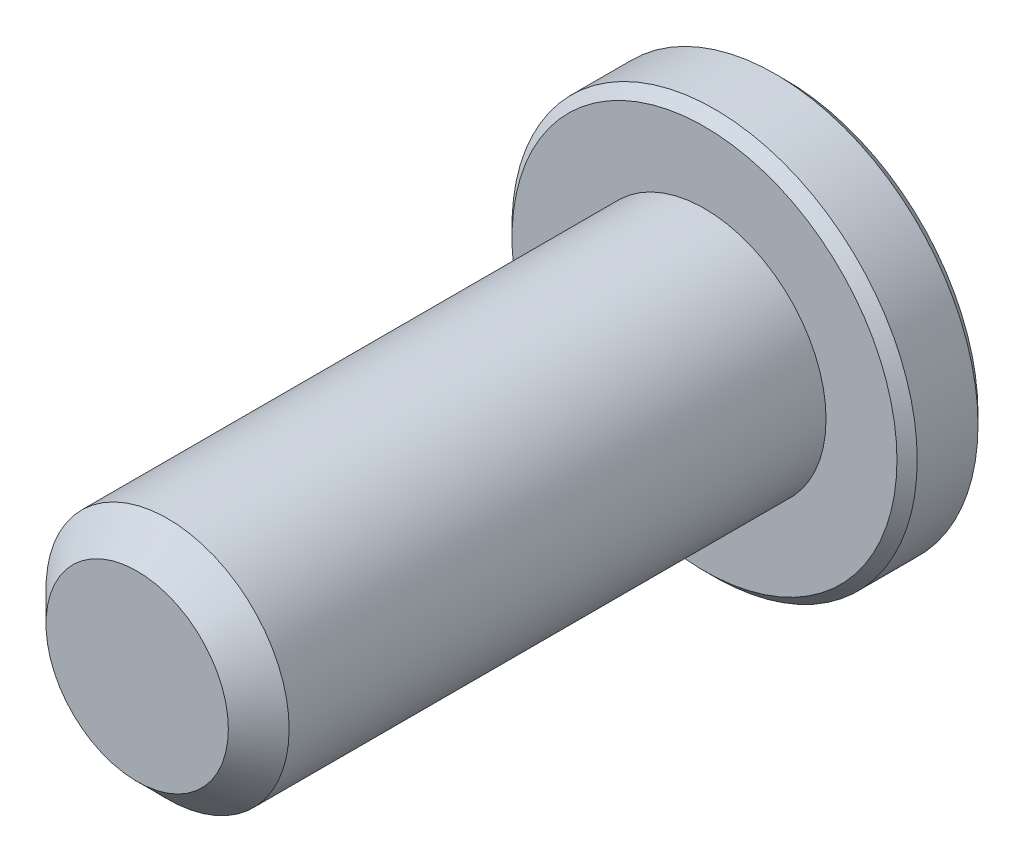
ISO-10303-21;
HEADER;
FILE_DESCRIPTION(('STEP AP214'),'2;1');
FILE_NAME('part.step','',(''),(''),'','','');
FILE_SCHEMA(('AUTOMOTIVE_DESIGN { 1 0 10303 214 1 1 1 1 }'));
ENDSEC;
DATA;
#1=APPLICATION_CONTEXT('core data for automotive mechanical design processes');
#2=APPLICATION_PROTOCOL_DEFINITION('international standard','automotive_design',2000,#1);
#3=PRODUCT_CONTEXT('',#1,'mechanical');
#4=PRODUCT('Part','Part','',(#3));
#5=PRODUCT_RELATED_PRODUCT_CATEGORY('part','',(#4));
#6=PRODUCT_DEFINITION_FORMATION('','',#4);
#7=PRODUCT_DEFINITION_CONTEXT('part definition',#1,'design');
#8=PRODUCT_DEFINITION('design','',#6,#7);
#9=PRODUCT_DEFINITION_SHAPE('','',#8);
#10=(LENGTH_UNIT() NAMED_UNIT(*) SI_UNIT(.MILLI.,.METRE.));
#11=(NAMED_UNIT(*) PLANE_ANGLE_UNIT() SI_UNIT($,.RADIAN.));
#12=(NAMED_UNIT(*) SI_UNIT($,.STERADIAN.) SOLID_ANGLE_UNIT());
#13=UNCERTAINTY_MEASURE_WITH_UNIT(LENGTH_MEASURE(1.E-05),#10,'distance_accuracy_value','');
#14=(GEOMETRIC_REPRESENTATION_CONTEXT(3) GLOBAL_UNCERTAINTY_ASSIGNED_CONTEXT((#13)) GLOBAL_UNIT_ASSIGNED_CONTEXT((#10,
#11,#12)) REPRESENTATION_CONTEXT('',''));
#15=CARTESIAN_POINT('',(0.,0.,0.));
#16=DIRECTION('',(0.,0.,1.));
#17=DIRECTION('',(1.,0.,0.));
#18=AXIS2_PLACEMENT_3D('',#15,#16,#17);
#19=CARTESIAN_POINT('',(0.,0.,-8.));
#20=DIRECTION('',(0.,0.,1.));
#21=DIRECTION('',(1.,0.,0.));
#22=AXIS2_PLACEMENT_3D('',#19,#20,#21);
#23=PLANE('',#22);
#24=CARTESIAN_POINT('',(0.,0.,-8.));
#25=DIRECTION('',(0.,0.,1.));
#26=DIRECTION('',(1.,0.,0.));
#27=AXIS2_PLACEMENT_3D('',#24,#25,#26);
#28=CIRCLE('',#27,4.75);
#29=CARTESIAN_POINT('',(4.75,0.,-8.));
#30=VERTEX_POINT('',#29);
#31=EDGE_CURVE('E160',#30,#30,#28,.F.);
#32=ORIENTED_EDGE('',*,*,#31,.T.);
#33=EDGE_LOOP('',(#32));
#34=FACE_BOUND('',#33,.T.);
#35=CARTESIAN_POINT('',(0.,0.,-8.));
#36=DIRECTION('',(0.,0.,1.));
#37=DIRECTION('',(1.,0.,0.));
#38=AXIS2_PLACEMENT_3D('',#35,#36,#37);
#39=CIRCLE('',#38,2.3094010767585);
#40=CARTESIAN_POINT('',(2.,1.15470053837925,-8.));
#41=VERTEX_POINT('',#40);
#42=CARTESIAN_POINT('',(0.,2.3094010767585,-8.));
#43=VERTEX_POINT('',#42);
#44=EDGE_CURVE('E99',#41,#43,#39,.T.);
#45=ORIENTED_EDGE('',*,*,#44,.T.);
#46=CARTESIAN_POINT('',(0.,0.,-8.));
#47=DIRECTION('',(0.,0.,1.));
#48=DIRECTION('',(1.,0.,0.));
#49=AXIS2_PLACEMENT_3D('',#46,#47,#48);
#50=CIRCLE('',#49,2.3094010767585);
#51=CARTESIAN_POINT('',(-2.,1.15470053837925,-8.));
#52=VERTEX_POINT('',#51);
#53=EDGE_CURVE('E111',#43,#52,#50,.T.);
#54=ORIENTED_EDGE('',*,*,#53,.T.);
#55=CARTESIAN_POINT('',(0.,0.,-8.));
#56=DIRECTION('',(0.,0.,1.));
#57=DIRECTION('',(1.,0.,0.));
#58=AXIS2_PLACEMENT_3D('',#55,#56,#57);
#59=CIRCLE('',#58,2.3094010767585);
#60=CARTESIAN_POINT('',(-2.,-1.15470053837925,-8.));
#61=VERTEX_POINT('',#60);
#62=EDGE_CURVE('E132',#52,#61,#59,.T.);
#63=ORIENTED_EDGE('',*,*,#62,.T.);
#64=CARTESIAN_POINT('',(0.,0.,-8.));
#65=DIRECTION('',(0.,0.,1.));
#66=DIRECTION('',(1.,0.,0.));
#67=AXIS2_PLACEMENT_3D('',#64,#65,#66);
#68=CIRCLE('',#67,2.3094010767585);
#69=CARTESIAN_POINT('',(0.,-2.3094010767585,-8.));
#70=VERTEX_POINT('',#69);
#71=EDGE_CURVE('E417',#61,#70,#68,.T.);
#72=ORIENTED_EDGE('',*,*,#71,.T.);
#73=CARTESIAN_POINT('',(0.,0.,-8.));
#74=DIRECTION('',(0.,0.,1.));
#75=DIRECTION('',(1.,0.,0.));
#76=AXIS2_PLACEMENT_3D('',#73,#74,#75);
#77=CIRCLE('',#76,2.3094010767585);
#78=CARTESIAN_POINT('',(2.,-1.15470053837925,-8.));
#79=VERTEX_POINT('',#78);
#80=EDGE_CURVE('E418',#70,#79,#77,.T.);
#81=ORIENTED_EDGE('',*,*,#80,.T.);
#82=CARTESIAN_POINT('',(0.,0.,-8.));
#83=DIRECTION('',(0.,0.,1.));
#84=DIRECTION('',(1.,0.,0.));
#85=AXIS2_PLACEMENT_3D('',#82,#83,#84);
#86=CIRCLE('',#85,2.3094010767585);
#87=EDGE_CURVE('E114',#79,#41,#86,.T.);
#88=ORIENTED_EDGE('',*,*,#87,.T.);
#89=EDGE_LOOP('',(#45,#54,#63,#72,#81,#88));
#90=FACE_BOUND('',#89,.T.);
#91=ADVANCED_FACE('F40',(#34,#90),#23,.F.);
#92=CARTESIAN_POINT('',(2.,1.15470053837925,-6.5));
#93=DIRECTION('',(-0.499999999999999,-0.866025403784439,0.));
#94=DIRECTION('',(0.866025403784439,-0.499999999999999,0.));
#95=AXIS2_PLACEMENT_3D('',#92,#93,#94);
#96=PLANE('',#95);
#97=DIRECTION('',(0.,0.,-1.));
#98=VECTOR('',#97,1.);
#99=CARTESIAN_POINT('',(0.,2.3094010767585,-6.5));
#100=LINE('',#99,#98);
#101=CARTESIAN_POINT('',(0.,2.3094010767585,-6.5));
#102=VERTEX_POINT('',#101);
#103=EDGE_CURVE('E128',#102,#43,#100,.T.);
#104=ORIENTED_EDGE('',*,*,#103,.T.);
#105=CARTESIAN_POINT('',(2.0002,1.15458506832541,-8.00011547871366));
#106=CARTESIAN_POINT('',(1.93144696596929,1.19427965103065,-7.96045309022559));
#107=CARTESIAN_POINT('',(1.86154425786449,1.23463799837204,-7.92311998228416));
#108=CARTESIAN_POINT('',(1.71900475544956,1.31693321846145,-7.85476368513614));
#109=CARTESIAN_POINT('',(1.64635440243464,1.35887791933134,-7.82377853373722));
#110=CARTESIAN_POINT('',(1.49985839894603,1.44345742638069,-7.77070021654414));
#111=CARTESIAN_POINT('',(1.4260500647537,1.48607068799507,-7.74847362717661));
#112=CARTESIAN_POINT('',(1.27680836816473,1.57223542169503,-7.71422881667508));
#113=CARTESIAN_POINT('',(1.20137956608184,1.61578426088223,-7.70218502914413));
#114=CARTESIAN_POINT('',(1.07138449932892,1.69083694766536,-7.69131851190557));
#115=CARTESIAN_POINT('',(1.01698621602989,1.72224381117151,-7.68970975360997));
#116=CARTESIAN_POINT('',(0.908278544480303,1.78500621460364,-7.69241887759871));
#117=CARTESIAN_POINT('',(0.853969194078657,1.81636173267754,-7.69673883775797));
#118=CARTESIAN_POINT('',(0.745863272410659,1.87877671565355,-7.71105956740991));
#119=CARTESIAN_POINT('',(0.692067343445204,1.90983580972306,-7.72106669276201));
#120=CARTESIAN_POINT('',(0.585405737694423,1.97141691651547,-7.74621243024966));
#121=CARTESIAN_POINT('',(0.532539989929284,2.00193897021859,-7.76135064904224));
#122=CARTESIAN_POINT('',(0.397120266910153,2.08012358375727,-7.80629450342919));
#123=CARTESIAN_POINT('',(0.315406165150519,2.12730124240478,-7.83948883942582));
#124=CARTESIAN_POINT('',(0.195252962742195,2.19667172615922,-7.89552582317137));
#125=CARTESIAN_POINT('',(0.155657147890821,2.21953238052245,-7.91521470294694));
#126=CARTESIAN_POINT('',(0.0771990411121258,2.26483018959123,-7.95638731836487));
#127=CARTESIAN_POINT('',(0.0383363164062579,2.28726759416161,-7.97786995165125));
#128=CARTESIAN_POINT('',(-0.00020000000000143,2.30951654681234,-8.00011547871366));
#129=B_SPLINE_CURVE_WITH_KNOTS('',3,(#105,#106,#107,#108,#109,#110,#111,#112,#113,#114,#115,
#116,#117,#118,#119,#120,#121,#122,#123,#124,#125,#126,#127,#128),.UNSPECIFIED.,.F.,.F.,(4,2,2,
2,2,2,2,2,2,2,2,4),(0.,0.266420613771064,0.534393751523389,0.798110374376915,1.06116288956936,
1.24939906803722,1.43770123566247,1.62621426093932,1.81471283831913,2.11415604834145,
2.2634717071779,2.4126962696977),.UNSPECIFIED.);
#130=EDGE_CURVE('E96',#41,#43,#129,.T.);
#131=ORIENTED_EDGE('',*,*,#130,.F.);
#132=DIRECTION('',(0.,0.,-1.));
#133=VECTOR('',#132,1.);
#134=CARTESIAN_POINT('',(2.,1.15470053837925,-6.5));
#135=LINE('',#134,#133);
#136=CARTESIAN_POINT('',(2.,1.15470053837925,-6.5));
#137=VERTEX_POINT('',#136);
#138=EDGE_CURVE('E395',#137,#41,#135,.T.);
#139=ORIENTED_EDGE('',*,*,#138,.F.);
#140=DIRECTION('',(-0.866025403784439,0.499999999999999,0.));
#141=VECTOR('',#140,1.);
#142=CARTESIAN_POINT('',(2.,1.15470053837925,-6.5));
#143=LINE('',#142,#141);
#144=EDGE_CURVE('E123',#137,#102,#143,.T.);
#145=ORIENTED_EDGE('',*,*,#144,.T.);
#146=EDGE_LOOP('',(#104,#131,#139,#145));
#147=FACE_BOUND('',#146,.T.);
#148=ADVANCED_FACE('F135',(#147),#96,.T.);
#149=CARTESIAN_POINT('',(2.,-1.15470053837925,-6.5));
#150=DIRECTION('',(-1.,0.,0.));
#151=DIRECTION('',(0.,-1.,0.));
#152=AXIS2_PLACEMENT_3D('',#149,#150,#151);
#153=PLANE('',#152);
#154=ORIENTED_EDGE('',*,*,#138,.T.);
#155=CARTESIAN_POINT('',(2.,-2.23549937670887,-8.69017513718668));
#156=CARTESIAN_POINT('',(2.,-2.1807527810435,-8.64938287180096));
#157=CARTESIAN_POINT('',(2.,-2.12569229943661,-8.60900569638314));
#158=CARTESIAN_POINT('',(2.,-2.0148226445702,-8.52926293233819));
#159=CARTESIAN_POINT('',(2.,-1.95901327979509,-8.48989761028182));
#160=CARTESIAN_POINT('',(2.,-1.84611729811028,-8.41208085304611));
#161=CARTESIAN_POINT('',(2.,-1.78902413232266,-8.37363887309905));
#162=CARTESIAN_POINT('',(2.,-1.67385795183992,-8.29826330524075));
#163=CARTESIAN_POINT('',(2.,-1.61578500814564,-8.26132960868766));
#164=CARTESIAN_POINT('',(2.,-1.43363866169992,-8.1494096906876));
#165=CARTESIAN_POINT('',(2.,-1.30762169581089,-8.07752720491179));
#166=CARTESIAN_POINT('',(2.,-1.04939309234471,-7.94646272873818));
#167=CARTESIAN_POINT('',(2.,-0.917204172269617,-7.88723804346547));
#168=CARTESIAN_POINT('',(2.,-0.718124984987984,-7.8148041590585));
#169=CARTESIAN_POINT('',(2.,-0.654042190204457,-7.79390698857068));
#170=CARTESIAN_POINT('',(2.,-0.524388769923568,-7.75726682008929));
#171=CARTESIAN_POINT('',(2.,-0.458818036623243,-7.74152419683206));
#172=CARTESIAN_POINT('',(2.,-0.327644241874374,-7.71625573335754));
#173=CARTESIAN_POINT('',(2.,-0.262061235219607,-7.70662737331007));
#174=CARTESIAN_POINT('',(2.,-0.130267847061914,-7.69376468439047));
#175=CARTESIAN_POINT('',(2.,-0.0640575622208006,-7.6905293859649));
#176=CARTESIAN_POINT('',(2.,0.0662403524896624,-7.69066851109366));
#177=CARTESIAN_POINT('',(2.,0.130328297737226,-7.69383531261846));
#178=CARTESIAN_POINT('',(2.,0.257921486730972,-7.70616059978116));
#179=CARTESIAN_POINT('',(2.,0.321426671256263,-7.71531968767288));
#180=CARTESIAN_POINT('',(2.,0.448468695628723,-7.73929657595525));
#181=CARTESIAN_POINT('',(2.,0.511987524654722,-7.75420841859142));
#182=CARTESIAN_POINT('',(2.,0.637645262926393,-7.78891873333844));
#183=CARTESIAN_POINT('',(2.,0.699784309324579,-7.80871671736778));
#184=CARTESIAN_POINT('',(2.,0.898631691500649,-7.87943332350435));
#185=CARTESIAN_POINT('',(2.,1.03242166016065,-7.93853646061718));
#186=CARTESIAN_POINT('',(2.,1.2936948848176,-8.06984386893366));
#187=CARTESIAN_POINT('',(2.,1.42115293421602,-8.1420958749312));
#188=CARTESIAN_POINT('',(2.,1.60534526733711,-8.25476923228805));
#189=CARTESIAN_POINT('',(2.,1.66407783886222,-8.2919864755451));
#190=CARTESIAN_POINT('',(2.,1.78053571406685,-8.36797661738813));
#191=CARTESIAN_POINT('',(2.,1.8382609404365,-8.40674963462693));
#192=CARTESIAN_POINT('',(2.,1.95236473925223,-8.4852415241609));
#193=CARTESIAN_POINT('',(2.,2.00875047098532,-8.52495004058222));
#194=CARTESIAN_POINT('',(2.,2.12075401913899,-8.60540490265382));
#195=CARTESIAN_POINT('',(2.,2.17637204190709,-8.64615096071051));
#196=CARTESIAN_POINT('',(2.,2.23166909348537,-8.68732162359563));
#197=B_SPLINE_CURVE_WITH_KNOTS('',3,(#155,#156,#157,#158,#159,#160,#161,#162,#163,#164,#165,
#166,#167,#168,#169,#170,#171,#172,#173,#174,#175,#176,#177,#178,#179,#180,#181,#182,#183,#184,
#185,#186,#187,#188,#189,#190,#191,#192,#193,#194,#195,#196),.UNSPECIFIED.,.F.,.F.,(4,2,2,2,2,2,
2,2,2,2,2,2,2,2,2,2,2,2,2,2,4),(0.,0.204822168658904,0.409697755456111,0.6161622341533,
0.822611814862053,1.25744760337585,1.69079269355485,1.89283154894661,2.0948850893337,
2.29345446193012,2.49199371775123,2.68419758165212,2.87642076594125,3.07192940138882,
3.26741851518362,3.70491849363615,4.14403963070311,4.3526147652202,4.56120583729728,
4.76808741684585,4.97491226257541),.UNSPECIFIED.);
#198=EDGE_CURVE('E104',#79,#41,#197,.T.);
#199=ORIENTED_EDGE('',*,*,#198,.F.);
#200=DIRECTION('',(0.,0.,-1.));
#201=VECTOR('',#200,1.);
#202=CARTESIAN_POINT('',(2.,-1.15470053837925,-6.5));
#203=LINE('',#202,#201);
#204=CARTESIAN_POINT('',(2.,-1.15470053837925,-6.5));
#205=VERTEX_POINT('',#204);
#206=EDGE_CURVE('E398',#205,#79,#203,.T.);
#207=ORIENTED_EDGE('',*,*,#206,.F.);
#208=DIRECTION('',(0.,1.,0.));
#209=VECTOR('',#208,1.);
#210=CARTESIAN_POINT('',(2.,-1.15470053837925,-6.5));
#211=LINE('',#210,#209);
#212=EDGE_CURVE('E56',#205,#137,#211,.T.);
#213=ORIENTED_EDGE('',*,*,#212,.T.);
#214=EDGE_LOOP('',(#154,#199,#207,#213));
#215=FACE_BOUND('',#214,.T.);
#216=ADVANCED_FACE('F184',(#215),#153,.T.);
#217=CARTESIAN_POINT('',(0.,-2.3094010767585,-6.5));
#218=DIRECTION('',(-0.5,0.866025403784438,0.));
#219=DIRECTION('',(-0.866025403784438,-0.5,0.));
#220=AXIS2_PLACEMENT_3D('',#217,#218,#219);
#221=PLANE('',#220);
#222=ORIENTED_EDGE('',*,*,#206,.T.);
#223=CARTESIAN_POINT('',(-0.000199999999999141,-2.30951654681234,-8.00011547871366));
#224=CARTESIAN_POINT('',(0.0685530340307063,-2.26982196410711,-7.96045309022559));
#225=CARTESIAN_POINT('',(0.138455742135512,-2.22946361676571,-7.92311998228416));
#226=CARTESIAN_POINT('',(0.280995244550437,-2.1471683966763,-7.85476368513614));
#227=CARTESIAN_POINT('',(0.353645597565359,-2.10522369580641,-7.82377853373722));
#228=CARTESIAN_POINT('',(0.500141601053972,-2.02064418875706,-7.77070021654414));
#229=CARTESIAN_POINT('',(0.573949935246294,-1.97803092714268,-7.74847362717661));
#230=CARTESIAN_POINT('',(0.723191631835264,-1.89186619344273,-7.71422881667508));
#231=CARTESIAN_POINT('',(0.798620433918152,-1.84831735425552,-7.70218502914413));
#232=CARTESIAN_POINT('',(0.928615500671079,-1.77326466747239,-7.69131851190557));
#233=CARTESIAN_POINT('',(0.983013783970109,-1.74185780396624,-7.68970975360997));
#234=CARTESIAN_POINT('',(1.09172145551969,-1.67909540053411,-7.69241887759871));
#235=CARTESIAN_POINT('',(1.14603080592134,-1.64773988246021,-7.69673883775797));
#236=CARTESIAN_POINT('',(1.25413672758934,-1.5853248994842,-7.7110595674099));
#237=CARTESIAN_POINT('',(1.30793265655479,-1.55426580541469,-7.72106669276201));
#238=CARTESIAN_POINT('',(1.41459426230557,-1.49268469862228,-7.74621243024966));
#239=CARTESIAN_POINT('',(1.46746001007071,-1.46216264491916,-7.76135064904224));
#240=CARTESIAN_POINT('',(1.60287973308984,-1.38397803138048,-7.80629450342919));
#241=CARTESIAN_POINT('',(1.68459383484948,-1.33680037273297,-7.83948883942581));
#242=CARTESIAN_POINT('',(1.8047470372578,-1.26742988897853,-7.89552582317137));
#243=CARTESIAN_POINT('',(1.84434285210917,-1.2445692346153,-7.91521470294694));
#244=CARTESIAN_POINT('',(1.92280095888787,-1.19927142554652,-7.95638731836487));
#245=CARTESIAN_POINT('',(1.96166368359374,-1.17683402097614,-7.97786995165125));
#246=CARTESIAN_POINT('',(2.0002,-1.15458506832541,-8.00011547871366));
#247=B_SPLINE_CURVE_WITH_KNOTS('',3,(#223,#224,#225,#226,#227,#228,#229,#230,#231,#232,#233,
#234,#235,#236,#237,#238,#239,#240,#241,#242,#243,#244,#245,#246),.UNSPECIFIED.,.F.,.F.,(4,2,2,
2,2,2,2,2,2,2,2,4),(0.,0.266420613771064,0.534393751523388,0.798110374376913,1.06116288956936,
1.24939906803722,1.43770123566247,1.62621426093931,1.81471283831913,2.11415604834144,
2.2634717071779,2.4126962696977),.UNSPECIFIED.);
#248=EDGE_CURVE('E426',#70,#79,#247,.T.);
#249=ORIENTED_EDGE('',*,*,#248,.F.);
#250=DIRECTION('',(0.,0.,-1.));
#251=VECTOR('',#250,1.);
#252=CARTESIAN_POINT('',(0.,-2.3094010767585,-6.5));
#253=LINE('',#252,#251);
#254=CARTESIAN_POINT('',(0.,-2.3094010767585,-6.5));
#255=VERTEX_POINT('',#254);
#256=EDGE_CURVE('E401',#255,#70,#253,.T.);
#257=ORIENTED_EDGE('',*,*,#256,.F.);
#258=DIRECTION('',(0.866025403784438,0.5,0.));
#259=VECTOR('',#258,1.);
#260=CARTESIAN_POINT('',(0.,-2.3094010767585,-6.5));
#261=LINE('',#260,#259);
#262=EDGE_CURVE('E64',#255,#205,#261,.T.);
#263=ORIENTED_EDGE('',*,*,#262,.T.);
#264=EDGE_LOOP('',(#222,#249,#257,#263));
#265=FACE_BOUND('',#264,.T.);
#266=ADVANCED_FACE('F302',(#265),#221,.T.);
#267=CARTESIAN_POINT('',(-2.,-1.15470053837925,-6.5));
#268=DIRECTION('',(0.5,0.866025403784439,0.));
#269=DIRECTION('',(-0.866025403784439,0.5,0.));
#270=AXIS2_PLACEMENT_3D('',#267,#268,#269);
#271=PLANE('',#270);
#272=ORIENTED_EDGE('',*,*,#256,.T.);
#273=CARTESIAN_POINT('',(-2.0002,-1.15458506832541,-8.00011547871366));
#274=CARTESIAN_POINT('',(-1.93144696596929,-1.19427965103064,-7.96045309022559));
#275=CARTESIAN_POINT('',(-1.86154425786449,-1.23463799837204,-7.92311998228416));
#276=CARTESIAN_POINT('',(-1.71900475544956,-1.31693321846145,-7.85476368513614));
#277=CARTESIAN_POINT('',(-1.64635440243464,-1.35887791933134,-7.82377853373722));
#278=CARTESIAN_POINT('',(-1.49985839894603,-1.44345742638069,-7.77070021654414));
#279=CARTESIAN_POINT('',(-1.4260500647537,-1.48607068799507,-7.74847362717661));
#280=CARTESIAN_POINT('',(-1.27680836816473,-1.57223542169502,-7.71422881667508));
#281=CARTESIAN_POINT('',(-1.20137956608185,-1.61578426088223,-7.70218502914413));
#282=CARTESIAN_POINT('',(-1.07138449932892,-1.69083694766536,-7.69131851190557));
#283=CARTESIAN_POINT('',(-1.01698621602989,-1.72224381117151,-7.68970975360997));
#284=CARTESIAN_POINT('',(-0.908278544480304,-1.78500621460364,-7.69241887759871));
#285=CARTESIAN_POINT('',(-0.853969194078658,-1.81636173267754,-7.69673883775797));
#286=CARTESIAN_POINT('',(-0.745863272410659,-1.87877671565355,-7.7110595674099));
#287=CARTESIAN_POINT('',(-0.692067343445205,-1.90983580972306,-7.72106669276201));
#288=CARTESIAN_POINT('',(-0.585405737694424,-1.97141691651547,-7.74621243024966));
#289=CARTESIAN_POINT('',(-0.532539989929284,-2.00193897021859,-7.76135064904224));
#290=CARTESIAN_POINT('',(-0.397120266910153,-2.08012358375727,-7.80629450342919));
#291=CARTESIAN_POINT('',(-0.31540616515052,-2.12730124240478,-7.83948883942581));
#292=CARTESIAN_POINT('',(-0.195252962742196,-2.19667172615922,-7.89552582317137));
#293=CARTESIAN_POINT('',(-0.155657147890822,-2.21953238052244,-7.91521470294694));
#294=CARTESIAN_POINT('',(-0.0771990411121268,-2.26483018959123,-7.95638731836487));
#295=CARTESIAN_POINT('',(-0.0383363164062588,-2.28726759416161,-7.97786995165124));
#296=CARTESIAN_POINT('',(0.000200000000000729,-2.30951654681234,-8.00011547871366));
#297=B_SPLINE_CURVE_WITH_KNOTS('',3,(#273,#274,#275,#276,#277,#278,#279,#280,#281,#282,#283,
#284,#285,#286,#287,#288,#289,#290,#291,#292,#293,#294,#295,#296),.UNSPECIFIED.,.F.,.F.,(4,2,2,
2,2,2,2,2,2,2,2,4),(0.,0.266420613771066,0.53439375152339,0.798110374376916,1.06116288956937,
1.24939906803722,1.43770123566248,1.62621426093932,1.81471283831913,2.11415604834145,
2.2634717071779,2.41269626969771),.UNSPECIFIED.);
#298=EDGE_CURVE('E414',#61,#70,#297,.T.);
#299=ORIENTED_EDGE('',*,*,#298,.F.);
#300=DIRECTION('',(0.,0.,-1.));
#301=VECTOR('',#300,1.);
#302=CARTESIAN_POINT('',(-2.,-1.15470053837925,-6.5));
#303=LINE('',#302,#301);
#304=CARTESIAN_POINT('',(-2.,-1.15470053837925,-6.5));
#305=VERTEX_POINT('',#304);
#306=EDGE_CURVE('E145',#305,#61,#303,.T.);
#307=ORIENTED_EDGE('',*,*,#306,.F.);
#308=DIRECTION('',(0.866025403784439,-0.499999999999999,0.));
#309=VECTOR('',#308,1.);
#310=CARTESIAN_POINT('',(-2.,-1.15470053837925,-6.5));
#311=LINE('',#310,#309);
#312=EDGE_CURVE('E388',#305,#255,#311,.T.);
#313=ORIENTED_EDGE('',*,*,#312,.T.);
#314=EDGE_LOOP('',(#272,#299,#307,#313));
#315=FACE_BOUND('',#314,.T.);
#316=ADVANCED_FACE('F310',(#315),#271,.T.);
#317=CARTESIAN_POINT('',(-2.,1.15470053837925,-6.5));
#318=DIRECTION('',(1.,0.,0.));
#319=DIRECTION('',(0.,1.,0.));
#320=AXIS2_PLACEMENT_3D('',#317,#318,#319);
#321=PLANE('',#320);
#322=ORIENTED_EDGE('',*,*,#306,.T.);
#323=CARTESIAN_POINT('',(-2.,-2.23549937670887,-8.69017513718668));
#324=CARTESIAN_POINT('',(-2.,-2.1807527810435,-8.64938287180096));
#325=CARTESIAN_POINT('',(-2.,-2.12569229943661,-8.60900569638314));
#326=CARTESIAN_POINT('',(-2.,-2.01482264457019,-8.52926293233819));
#327=CARTESIAN_POINT('',(-2.,-1.95901327979509,-8.48989761028182));
#328=CARTESIAN_POINT('',(-2.,-1.84611729811028,-8.41208085304611));
#329=CARTESIAN_POINT('',(-2.,-1.78902413232266,-8.37363887309905));
#330=CARTESIAN_POINT('',(-2.,-1.67385795183992,-8.29826330524075));
#331=CARTESIAN_POINT('',(-2.,-1.61578500814564,-8.26132960868766));
#332=CARTESIAN_POINT('',(-2.,-1.43363866169992,-8.1494096906876));
#333=CARTESIAN_POINT('',(-2.,-1.30762169581089,-8.07752720491179));
#334=CARTESIAN_POINT('',(-2.,-1.04939309234471,-7.94646272873819));
#335=CARTESIAN_POINT('',(-2.,-0.917204172269616,-7.88723804346547));
#336=CARTESIAN_POINT('',(-2.,-0.718124984987984,-7.8148041590585));
#337=CARTESIAN_POINT('',(-2.,-0.654042190204457,-7.79390698857069));
#338=CARTESIAN_POINT('',(-2.,-0.524388769923568,-7.75726682008929));
#339=CARTESIAN_POINT('',(-2.,-0.458818036623243,-7.74152419683206));
#340=CARTESIAN_POINT('',(-2.,-0.327644241874374,-7.71625573335754));
#341=CARTESIAN_POINT('',(-2.,-0.262061235219607,-7.70662737331007));
#342=CARTESIAN_POINT('',(-2.,-0.130267847061914,-7.69376468439048));
#343=CARTESIAN_POINT('',(-2.,-0.0640575622208007,-7.69052938596491));
#344=CARTESIAN_POINT('',(-2.,0.0662403524896622,-7.69066851109366));
#345=CARTESIAN_POINT('',(-2.,0.130328297737226,-7.69383531261846));
#346=CARTESIAN_POINT('',(-2.,0.257921486730972,-7.70616059978116));
#347=CARTESIAN_POINT('',(-2.,0.321426671256263,-7.71531968767289));
#348=CARTESIAN_POINT('',(-2.,0.448468695628723,-7.73929657595526));
#349=CARTESIAN_POINT('',(-2.,0.511987524654722,-7.75420841859142));
#350=CARTESIAN_POINT('',(-2.,0.637645262926393,-7.78891873333844));
#351=CARTESIAN_POINT('',(-2.,0.699784309324579,-7.80871671736778));
#352=CARTESIAN_POINT('',(-2.,0.898631691500649,-7.87943332350436));
#353=CARTESIAN_POINT('',(-2.,1.03242166016065,-7.93853646061719));
#354=CARTESIAN_POINT('',(-2.,1.2936948848176,-8.06984386893366));
#355=CARTESIAN_POINT('',(-2.,1.42115293421602,-8.1420958749312));
#356=CARTESIAN_POINT('',(-2.,1.60534526733711,-8.25476923228805));
#357=CARTESIAN_POINT('',(-2.,1.66407783886222,-8.2919864755451));
#358=CARTESIAN_POINT('',(-2.,1.78053571406685,-8.36797661738813));
#359=CARTESIAN_POINT('',(-2.,1.8382609404365,-8.40674963462693));
#360=CARTESIAN_POINT('',(-2.,1.95236473925223,-8.4852415241609));
#361=CARTESIAN_POINT('',(-2.,2.00875047098532,-8.52495004058223));
#362=CARTESIAN_POINT('',(-2.,2.12075401913899,-8.60540490265382));
#363=CARTESIAN_POINT('',(-2.,2.17637204190709,-8.64615096071051));
#364=CARTESIAN_POINT('',(-2.,2.23166909348537,-8.68732162359563));
#365=B_SPLINE_CURVE_WITH_KNOTS('',3,(#323,#324,#325,#326,#327,#328,#329,#330,#331,#332,#333,
#334,#335,#336,#337,#338,#339,#340,#341,#342,#343,#344,#345,#346,#347,#348,#349,#350,#351,#352,
#353,#354,#355,#356,#357,#358,#359,#360,#361,#362,#363,#364),.UNSPECIFIED.,.F.,.F.,(4,2,2,2,2,2,
2,2,2,2,2,2,2,2,2,2,2,2,2,2,4),(0.,0.204822168658905,0.409697755456112,0.616162234153302,
0.822611814862055,1.25744760337585,1.69079269355485,1.89283154894661,2.0948850893337,
2.29345446193012,2.49199371775123,2.68419758165212,2.87642076594125,3.07192940138881,
3.26741851518362,3.70491849363614,4.14403963070311,4.3526147652202,4.56120583729728,
4.76808741684584,4.97491226257541),.UNSPECIFIED.);
#366=EDGE_CURVE('E409',#52,#61,#365,.F.);
#367=ORIENTED_EDGE('',*,*,#366,.F.);
#368=DIRECTION('',(0.,0.,-1.));
#369=VECTOR('',#368,1.);
#370=CARTESIAN_POINT('',(-2.,1.15470053837925,-6.5));
#371=LINE('',#370,#369);
#372=CARTESIAN_POINT('',(-2.,1.15470053837925,-6.5));
#373=VERTEX_POINT('',#372);
#374=EDGE_CURVE('E130',#373,#52,#371,.T.);
#375=ORIENTED_EDGE('',*,*,#374,.F.);
#376=DIRECTION('',(0.,-1.,0.));
#377=VECTOR('',#376,1.);
#378=CARTESIAN_POINT('',(-2.,1.15470053837925,-6.5));
#379=LINE('',#378,#377);
#380=EDGE_CURVE('E385',#373,#305,#379,.T.);
#381=ORIENTED_EDGE('',*,*,#380,.T.);
#382=EDGE_LOOP('',(#322,#367,#375,#381));
#383=FACE_BOUND('',#382,.T.);
#384=ADVANCED_FACE('F318',(#383),#321,.T.);
#385=CARTESIAN_POINT('',(0.,2.3094010767585,-6.5));
#386=DIRECTION('',(0.5,-0.866025403784438,0.));
#387=DIRECTION('',(0.866025403784439,0.5,0.));
#388=AXIS2_PLACEMENT_3D('',#385,#386,#387);
#389=PLANE('',#388);
#390=ORIENTED_EDGE('',*,*,#374,.T.);
#391=CARTESIAN_POINT('',(0.000199999999998355,2.30951654681234,-8.00011547871366));
#392=CARTESIAN_POINT('',(-0.0685530340307067,2.26982196410711,-7.96045309022559));
#393=CARTESIAN_POINT('',(-0.138455742135513,2.22946361676571,-7.92311998228416));
#394=CARTESIAN_POINT('',(-0.280995244550437,2.1471683966763,-7.85476368513614));
#395=CARTESIAN_POINT('',(-0.353645597565359,2.10522369580642,-7.82377853373722));
#396=CARTESIAN_POINT('',(-0.500141601053972,2.02064418875706,-7.77070021654414));
#397=CARTESIAN_POINT('',(-0.573949935246295,1.97803092714269,-7.74847362717661));
#398=CARTESIAN_POINT('',(-0.723191631835265,1.89186619344273,-7.71422881667508));
#399=CARTESIAN_POINT('',(-0.798620433918153,1.84831735425552,-7.70218502914414));
#400=CARTESIAN_POINT('',(-0.92861550067108,1.7732646674724,-7.69131851190557));
#401=CARTESIAN_POINT('',(-0.983013783970109,1.74185780396625,-7.68970975360997));
#402=CARTESIAN_POINT('',(-1.09172145551969,1.67909540053412,-7.69241887759871));
#403=CARTESIAN_POINT('',(-1.14603080592134,1.64773988246021,-7.69673883775797));
#404=CARTESIAN_POINT('',(-1.25413672758934,1.5853248994842,-7.71105956740991));
#405=CARTESIAN_POINT('',(-1.30793265655479,1.55426580541469,-7.72106669276201));
#406=CARTESIAN_POINT('',(-1.41459426230557,1.49268469862228,-7.74621243024966));
#407=CARTESIAN_POINT('',(-1.46746001007071,1.46216264491916,-7.76135064904224));
#408=CARTESIAN_POINT('',(-1.60287973308984,1.38397803138048,-7.80629450342919));
#409=CARTESIAN_POINT('',(-1.68459383484948,1.33680037273297,-7.83948883942582));
#410=CARTESIAN_POINT('',(-1.8047470372578,1.26742988897853,-7.89552582317137));
#411=CARTESIAN_POINT('',(-1.84434285210918,1.24456923461531,-7.91521470294694));
#412=CARTESIAN_POINT('',(-1.92280095888787,1.19927142554652,-7.95638731836487));
#413=CARTESIAN_POINT('',(-1.96166368359374,1.17683402097614,-7.97786995165125));
#414=CARTESIAN_POINT('',(-2.0002,1.15458506832541,-8.00011547871366));
#415=B_SPLINE_CURVE_WITH_KNOTS('',3,(#391,#392,#393,#394,#395,#396,#397,#398,#399,#400,#401,
#402,#403,#404,#405,#406,#407,#408,#409,#410,#411,#412,#413,#414),.UNSPECIFIED.,.F.,.F.,(4,2,2,
2,2,2,2,2,2,2,2,4),(0.,0.266420613771063,0.534393751523388,0.798110374376913,1.06116288956936,
1.24939906803721,1.43770123566247,1.62621426093931,1.81471283831913,2.11415604834144,
2.2634717071779,2.4126962696977),.UNSPECIFIED.);
#416=EDGE_CURVE('E121',#43,#52,#415,.T.);
#417=ORIENTED_EDGE('',*,*,#416,.F.);
#418=ORIENTED_EDGE('',*,*,#103,.F.);
#419=DIRECTION('',(-0.866025403784439,-0.5,0.));
#420=VECTOR('',#419,1.);
#421=CARTESIAN_POINT('',(0.,2.3094010767585,-6.5));
#422=LINE('',#421,#420);
#423=EDGE_CURVE('E382',#102,#373,#422,.T.);
#424=ORIENTED_EDGE('',*,*,#423,.T.);
#425=EDGE_LOOP('',(#390,#417,#418,#424));
#426=FACE_BOUND('',#425,.T.);
#427=ADVANCED_FACE('F127',(#426),#389,.T.);
#428=CARTESIAN_POINT('',(0.,0.,8.));
#429=DIRECTION('',(0.,0.,-1.));
#430=DIRECTION('',(-1.,0.,0.));
#431=AXIS2_PLACEMENT_3D('',#428,#429,#430);
#432=CYLINDRICAL_SURFACE('',#431,3.);
#433=CARTESIAN_POINT('',(0.,0.,7.25));
#434=DIRECTION('',(0.,0.,1.));
#435=DIRECTION('',(1.,0.,0.));
#436=AXIS2_PLACEMENT_3D('',#433,#434,#435);
#437=CIRCLE('',#436,3.);
#438=CARTESIAN_POINT('',(3.,0.,7.25));
#439=VERTEX_POINT('',#438);
#440=EDGE_CURVE('E11',#439,#439,#437,.F.);
#441=ORIENTED_EDGE('',*,*,#440,.T.);
#442=EDGE_LOOP('',(#441));
#443=FACE_BOUND('',#442,.T.);
#444=CARTESIAN_POINT('',(0.,0.,-6.));
#445=DIRECTION('',(0.,0.,1.));
#446=DIRECTION('',(1.,0.,0.));
#447=AXIS2_PLACEMENT_3D('',#444,#445,#446);
#448=CIRCLE('',#447,3.);
#449=CARTESIAN_POINT('',(3.,0.,-6.));
#450=VERTEX_POINT('',#449);
#451=EDGE_CURVE('E138',#450,#450,#448,.T.);
#452=ORIENTED_EDGE('',*,*,#451,.T.);
#453=EDGE_LOOP('',(#452));
#454=FACE_BOUND('',#453,.T.);
#455=ADVANCED_FACE('F196',(#443,#454),#432,.T.);
#456=CARTESIAN_POINT('',(0.,0.,8.));
#457=DIRECTION('',(0.,0.,1.));
#458=DIRECTION('',(1.,0.,0.));
#459=AXIS2_PLACEMENT_3D('',#456,#457,#458);
#460=PLANE('',#459);
#461=CARTESIAN_POINT('',(0.,0.,8.));
#462=DIRECTION('',(0.,0.,1.));
#463=DIRECTION('',(1.,0.,0.));
#464=AXIS2_PLACEMENT_3D('',#461,#462,#463);
#465=CIRCLE('',#464,2.25000000000001);
#466=CARTESIAN_POINT('',(2.25000000000001,0.,8.));
#467=VERTEX_POINT('',#466);
#468=EDGE_CURVE('E49',#467,#467,#465,.T.);
#469=ORIENTED_EDGE('',*,*,#468,.T.);
#470=EDGE_LOOP('',(#469));
#471=FACE_BOUND('',#470,.T.);
#472=ADVANCED_FACE('F167',(#471),#460,.T.);
#473=CARTESIAN_POINT('',(0.,0.,-6.));
#474=DIRECTION('',(0.,0.,1.));
#475=DIRECTION('',(1.,0.,0.));
#476=AXIS2_PLACEMENT_3D('',#473,#474,#475);
#477=PLANE('',#476);
#478=CARTESIAN_POINT('',(0.,0.,-6.));
#479=DIRECTION('',(0.,0.,1.));
#480=DIRECTION('',(1.,0.,0.));
#481=AXIS2_PLACEMENT_3D('',#478,#479,#480);
#482=CIRCLE('',#481,4.75);
#483=CARTESIAN_POINT('',(4.75,0.,-6.));
#484=VERTEX_POINT('',#483);
#485=EDGE_CURVE('E143',#484,#484,#482,.T.);
#486=ORIENTED_EDGE('',*,*,#485,.T.);
#487=EDGE_LOOP('',(#486));
#488=FACE_BOUND('',#487,.T.);
#489=ORIENTED_EDGE('',*,*,#451,.F.);
#490=EDGE_LOOP('',(#489));
#491=FACE_BOUND('',#490,.T.);
#492=ADVANCED_FACE('F188',(#488,#491),#477,.T.);
#493=CARTESIAN_POINT('',(0.,0.,-6.));
#494=DIRECTION('',(0.,0.,-1.));
#495=DIRECTION('',(-1.,0.,0.));
#496=AXIS2_PLACEMENT_3D('',#493,#494,#495);
#497=CYLINDRICAL_SURFACE('',#496,5.);
#498=CARTESIAN_POINT('',(0.,0.,-6.25));
#499=DIRECTION('',(0.,0.,1.));
#500=DIRECTION('',(1.,0.,0.));
#501=AXIS2_PLACEMENT_3D('',#498,#499,#500);
#502=CIRCLE('',#501,5.);
#503=CARTESIAN_POINT('',(5.,0.,-6.25));
#504=VERTEX_POINT('',#503);
#505=EDGE_CURVE('E156',#504,#504,#502,.F.);
#506=ORIENTED_EDGE('',*,*,#505,.T.);
#507=EDGE_LOOP('',(#506));
#508=FACE_BOUND('',#507,.T.);
#509=CARTESIAN_POINT('',(0.,0.,-7.75));
#510=DIRECTION('',(0.,0.,1.));
#511=DIRECTION('',(1.,0.,0.));
#512=AXIS2_PLACEMENT_3D('',#509,#510,#511);
#513=CIRCLE('',#512,5.);
#514=CARTESIAN_POINT('',(5.,0.,-7.75));
#515=VERTEX_POINT('',#514);
#516=EDGE_CURVE('E152',#515,#515,#513,.T.);
#517=ORIENTED_EDGE('',*,*,#516,.T.);
#518=EDGE_LOOP('',(#517));
#519=FACE_BOUND('',#518,.T.);
#520=ADVANCED_FACE('F189',(#508,#519),#497,.T.);
#521=CARTESIAN_POINT('',(-2.,3.46410161513775,-6.5));
#522=DIRECTION('',(0.,0.,1.));
#523=DIRECTION('',(1.,0.,0.));
#524=AXIS2_PLACEMENT_3D('',#521,#522,#523);
#525=PLANE('',#524);
#526=ORIENTED_EDGE('',*,*,#144,.F.);
#527=ORIENTED_EDGE('',*,*,#212,.F.);
#528=ORIENTED_EDGE('',*,*,#262,.F.);
#529=ORIENTED_EDGE('',*,*,#312,.F.);
#530=ORIENTED_EDGE('',*,*,#380,.F.);
#531=ORIENTED_EDGE('',*,*,#423,.F.);
#532=EDGE_LOOP('',(#526,#527,#528,#529,#530,#531));
#533=FACE_BOUND('',#532,.T.);
#534=ADVANCED_FACE('F192',(#533),#525,.F.);
#535=CARTESIAN_POINT('',(0.,0.,-8.));
#536=DIRECTION('',(0.,0.,-1.));
#537=DIRECTION('',(1.,0.,0.));
#538=AXIS2_PLACEMENT_3D('',#535,#536,#537);
#539=CONICAL_SURFACE('',#538,2.3094010767585,0.78539816339745);
#540=ORIENTED_EDGE('',*,*,#416,.T.);
#541=ORIENTED_EDGE('',*,*,#53,.F.);
#542=EDGE_LOOP('',(#540,#541));
#543=FACE_BOUND('',#542,.T.);
#544=ADVANCED_FACE('F120',(#543),#539,.F.);
#545=CARTESIAN_POINT('',(0.,0.,-8.));
#546=DIRECTION('',(0.,0.,-1.));
#547=DIRECTION('',(1.,0.,0.));
#548=AXIS2_PLACEMENT_3D('',#545,#546,#547);
#549=CONICAL_SURFACE('',#548,2.3094010767585,0.78539816339745);
#550=ORIENTED_EDGE('',*,*,#366,.T.);
#551=ORIENTED_EDGE('',*,*,#62,.F.);
#552=EDGE_LOOP('',(#550,#551));
#553=FACE_BOUND('',#552,.T.);
#554=ADVANCED_FACE('F237',(#553),#549,.F.);
#555=CARTESIAN_POINT('',(0.,0.,-8.));
#556=DIRECTION('',(0.,0.,-1.));
#557=DIRECTION('',(1.,0.,0.));
#558=AXIS2_PLACEMENT_3D('',#555,#556,#557);
#559=CONICAL_SURFACE('',#558,2.3094010767585,0.78539816339745);
#560=ORIENTED_EDGE('',*,*,#298,.T.);
#561=ORIENTED_EDGE('',*,*,#71,.F.);
#562=EDGE_LOOP('',(#560,#561));
#563=FACE_BOUND('',#562,.T.);
#564=ADVANCED_FACE('F245',(#563),#559,.F.);
#565=CARTESIAN_POINT('',(0.,0.,-8.));
#566=DIRECTION('',(0.,0.,-1.));
#567=DIRECTION('',(1.,0.,0.));
#568=AXIS2_PLACEMENT_3D('',#565,#566,#567);
#569=CONICAL_SURFACE('',#568,2.3094010767585,0.78539816339745);
#570=ORIENTED_EDGE('',*,*,#248,.T.);
#571=ORIENTED_EDGE('',*,*,#80,.F.);
#572=EDGE_LOOP('',(#570,#571));
#573=FACE_BOUND('',#572,.T.);
#574=ADVANCED_FACE('F253',(#573),#569,.F.);
#575=CARTESIAN_POINT('',(0.,0.,-8.));
#576=DIRECTION('',(0.,0.,-1.));
#577=DIRECTION('',(1.,0.,0.));
#578=AXIS2_PLACEMENT_3D('',#575,#576,#577);
#579=CONICAL_SURFACE('',#578,2.3094010767585,0.78539816339745);
#580=ORIENTED_EDGE('',*,*,#198,.T.);
#581=ORIENTED_EDGE('',*,*,#87,.F.);
#582=EDGE_LOOP('',(#580,#581));
#583=FACE_BOUND('',#582,.T.);
#584=ADVANCED_FACE('F205',(#583),#579,.F.);
#585=CARTESIAN_POINT('',(0.,0.,-8.));
#586=DIRECTION('',(0.,0.,-1.));
#587=DIRECTION('',(1.,0.,0.));
#588=AXIS2_PLACEMENT_3D('',#585,#586,#587);
#589=CONICAL_SURFACE('',#588,2.3094010767585,0.78539816339745);
#590=ORIENTED_EDGE('',*,*,#130,.T.);
#591=ORIENTED_EDGE('',*,*,#44,.F.);
#592=EDGE_LOOP('',(#590,#591));
#593=FACE_BOUND('',#592,.T.);
#594=ADVANCED_FACE('F98',(#593),#589,.F.);
#595=CARTESIAN_POINT('',(0.,0.,-6.));
#596=DIRECTION('',(0.,0.,-1.));
#597=DIRECTION('',(-1.,0.,0.));
#598=AXIS2_PLACEMENT_3D('',#595,#596,#597);
#599=CONICAL_SURFACE('',#598,4.75,0.785398163397448);
#600=ORIENTED_EDGE('',*,*,#505,.F.);
#601=EDGE_LOOP('',(#600));
#602=FACE_BOUND('',#601,.T.);
#603=ORIENTED_EDGE('',*,*,#485,.F.);
#604=EDGE_LOOP('',(#603));
#605=FACE_BOUND('',#604,.T.);
#606=ADVANCED_FACE('F175',(#602,#605),#599,.T.);
#607=CARTESIAN_POINT('',(0.,0.,-7.75));
#608=DIRECTION('',(0.,0.,1.));
#609=DIRECTION('',(1.,0.,0.));
#610=AXIS2_PLACEMENT_3D('',#607,#608,#609);
#611=CONICAL_SURFACE('',#610,5.,0.785398163397452);
#612=ORIENTED_EDGE('',*,*,#31,.F.);
#613=EDGE_LOOP('',(#612));
#614=FACE_BOUND('',#613,.T.);
#615=ORIENTED_EDGE('',*,*,#516,.F.);
#616=EDGE_LOOP('',(#615));
#617=FACE_BOUND('',#616,.T.);
#618=ADVANCED_FACE('F170',(#614,#617),#611,.T.);
#619=CARTESIAN_POINT('',(0.,0.,8.));
#620=DIRECTION('',(0.,0.,-1.));
#621=DIRECTION('',(-1.,0.,0.));
#622=AXIS2_PLACEMENT_3D('',#619,#620,#621);
#623=CONICAL_SURFACE('',#622,2.25000000000001,0.785398163397446);
#624=ORIENTED_EDGE('',*,*,#440,.F.);
#625=EDGE_LOOP('',(#624));
#626=FACE_BOUND('',#625,.T.);
#627=ORIENTED_EDGE('',*,*,#468,.F.);
#628=EDGE_LOOP('',(#627));
#629=FACE_BOUND('',#628,.T.);
#630=ADVANCED_FACE('F42',(#626,#629),#623,.T.);
#631=CLOSED_SHELL('',(#91,#148,#216,#266,#316,#384,#427,#455,#472,#492,#520,#534,#544,#554,#564,
#574,#584,#594,#606,#618,#630));
#632=MANIFOLD_SOLID_BREP('B2',#631);
#633=ADVANCED_BREP_SHAPE_REPRESENTATION('',(#18,#632),#14);
#634=SHAPE_DEFINITION_REPRESENTATION(#9,#633);
ENDSEC;
END-ISO-10303-21;
